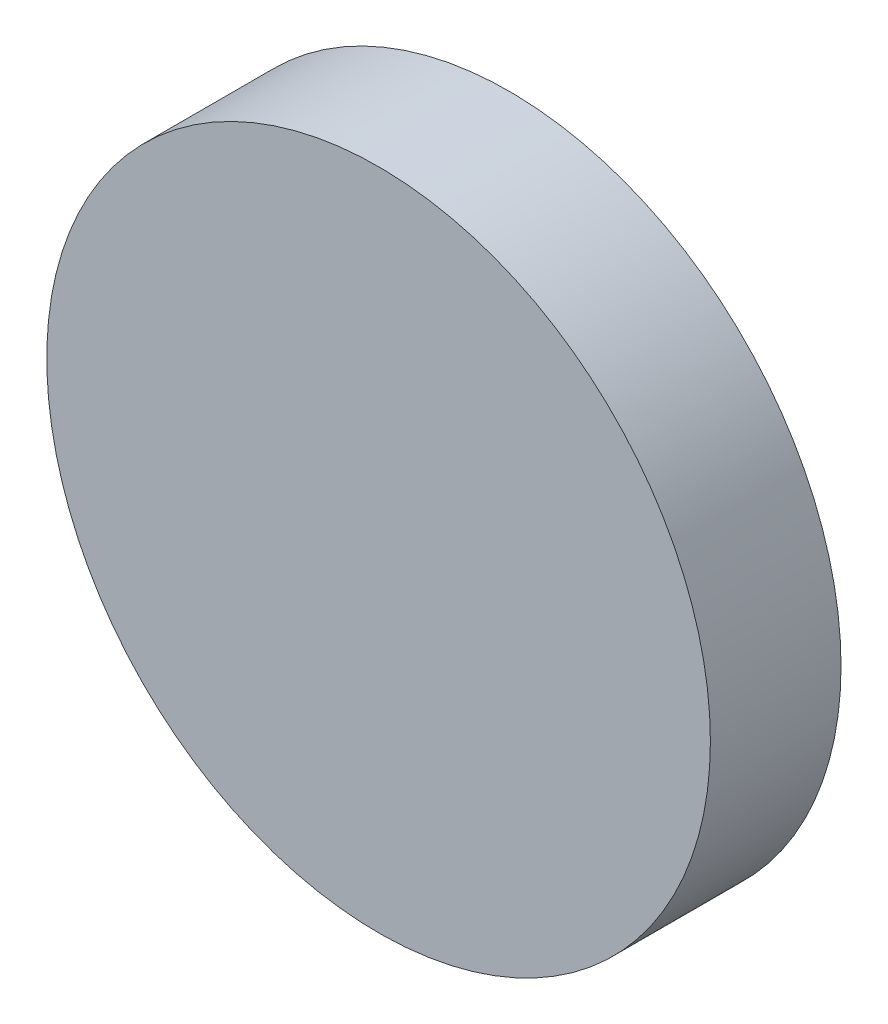
ISO-10303-21;
HEADER;
FILE_DESCRIPTION(('STEP AP214'),'2;1');
FILE_NAME('part.step','',(''),(''),'','','');
FILE_SCHEMA(('AUTOMOTIVE_DESIGN { 1 0 10303 214 1 1 1 1 }'));
ENDSEC;
DATA;
#1=APPLICATION_CONTEXT('core data for automotive mechanical design processes');
#2=APPLICATION_PROTOCOL_DEFINITION('international standard','automotive_design',2000,#1);
#3=PRODUCT_CONTEXT('',#1,'mechanical');
#4=PRODUCT('Part','Part','',(#3));
#5=PRODUCT_RELATED_PRODUCT_CATEGORY('part','',(#4));
#6=PRODUCT_DEFINITION_FORMATION('','',#4);
#7=PRODUCT_DEFINITION_CONTEXT('part definition',#1,'design');
#8=PRODUCT_DEFINITION('design','',#6,#7);
#9=PRODUCT_DEFINITION_SHAPE('','',#8);
#10=(LENGTH_UNIT() NAMED_UNIT(*) SI_UNIT(.MILLI.,.METRE.));
#11=(NAMED_UNIT(*) PLANE_ANGLE_UNIT() SI_UNIT($,.RADIAN.));
#12=(NAMED_UNIT(*) SI_UNIT($,.STERADIAN.) SOLID_ANGLE_UNIT());
#13=UNCERTAINTY_MEASURE_WITH_UNIT(LENGTH_MEASURE(1.E-05),#10,'distance_accuracy_value','');
#14=(GEOMETRIC_REPRESENTATION_CONTEXT(3) GLOBAL_UNCERTAINTY_ASSIGNED_CONTEXT((#13)) GLOBAL_UNIT_ASSIGNED_CONTEXT((#10,
#11,#12)) REPRESENTATION_CONTEXT('',''));
#15=CARTESIAN_POINT('',(0.,0.,0.));
#16=DIRECTION('',(0.,0.,1.));
#17=DIRECTION('',(1.,0.,0.));
#18=AXIS2_PLACEMENT_3D('',#15,#16,#17);
#19=CARTESIAN_POINT('',(0.,0.,10.));
#20=DIRECTION('',(0.,0.,-1.));
#21=DIRECTION('',(-1.,0.,0.));
#22=AXIS2_PLACEMENT_3D('',#19,#20,#21);
#23=CYLINDRICAL_SURFACE('',#22,25.4);
#24=CARTESIAN_POINT('',(0.,0.,10.));
#25=DIRECTION('',(0.,0.,1.));
#26=DIRECTION('',(1.,0.,0.));
#27=AXIS2_PLACEMENT_3D('',#24,#25,#26);
#28=CIRCLE('',#27,25.4);
#29=CARTESIAN_POINT('',(25.4,0.,10.));
#30=VERTEX_POINT('',#29);
#31=EDGE_CURVE('E10',#30,#30,#28,.T.);
#32=ORIENTED_EDGE('',*,*,#31,.F.);
#33=EDGE_LOOP('',(#32));
#34=FACE_BOUND('',#33,.T.);
#35=CARTESIAN_POINT('',(0.,0.,0.));
#36=DIRECTION('',(0.,0.,1.));
#37=DIRECTION('',(1.,0.,0.));
#38=AXIS2_PLACEMENT_3D('',#35,#36,#37);
#39=CIRCLE('',#38,25.4);
#40=CARTESIAN_POINT('',(25.4,0.,0.));
#41=VERTEX_POINT('',#40);
#42=EDGE_CURVE('E42',#41,#41,#39,.T.);
#43=ORIENTED_EDGE('',*,*,#42,.T.);
#44=EDGE_LOOP('',(#43));
#45=FACE_BOUND('',#44,.T.);
#46=ADVANCED_FACE('F39',(#34,#45),#23,.T.);
#47=CARTESIAN_POINT('',(0.,0.,10.));
#48=DIRECTION('',(0.,0.,1.));
#49=DIRECTION('',(1.,0.,0.));
#50=AXIS2_PLACEMENT_3D('',#47,#48,#49);
#51=PLANE('',#50);
#52=ORIENTED_EDGE('',*,*,#31,.T.);
#53=EDGE_LOOP('',(#52));
#54=FACE_BOUND('',#53,.T.);
#55=ADVANCED_FACE('F56',(#54),#51,.T.);
#56=CARTESIAN_POINT('',(0.,0.,0.));
#57=DIRECTION('',(0.,0.,1.));
#58=DIRECTION('',(1.,0.,0.));
#59=AXIS2_PLACEMENT_3D('',#56,#57,#58);
#60=PLANE('',#59);
#61=ORIENTED_EDGE('',*,*,#42,.F.);
#62=EDGE_LOOP('',(#61));
#63=FACE_BOUND('',#62,.T.);
#64=ADVANCED_FACE('F54',(#63),#60,.F.);
#65=CLOSED_SHELL('',(#46,#55,#64));
#66=MANIFOLD_SOLID_BREP('B2',#65);
#67=ADVANCED_BREP_SHAPE_REPRESENTATION('',(#18,#66),#14);
#68=SHAPE_DEFINITION_REPRESENTATION(#9,#67);
ENDSEC;
END-ISO-10303-21;
